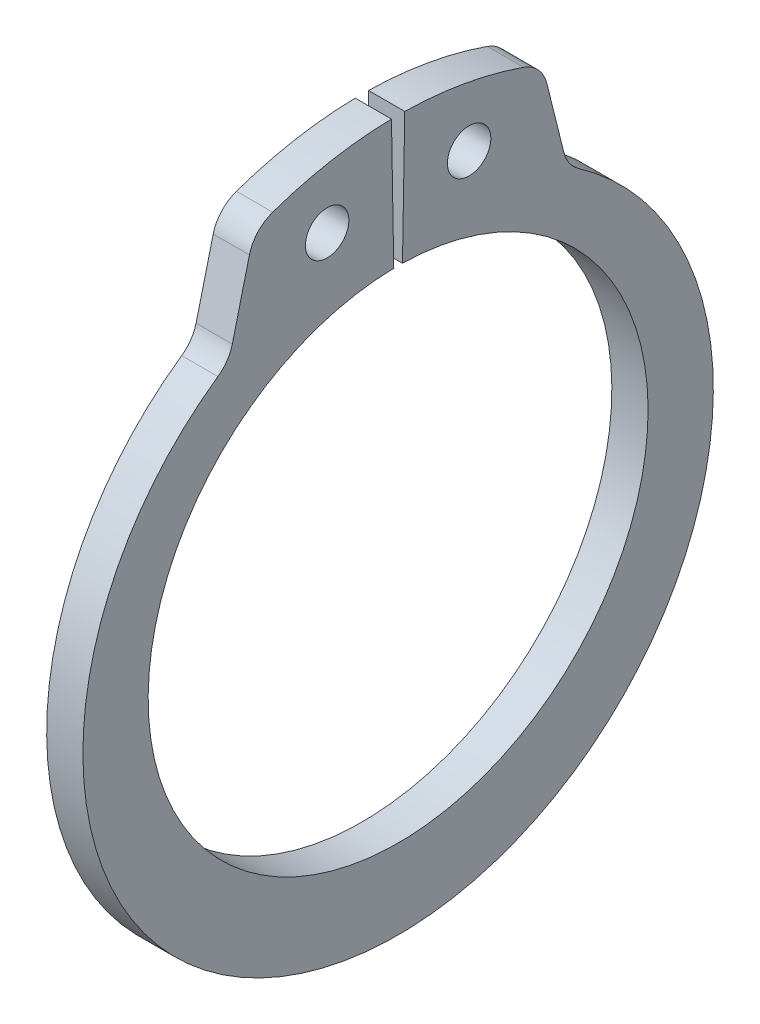
ISO-10303-21;
HEADER;
FILE_DESCRIPTION(('STEP AP214'),'2;1');
FILE_NAME('part.step','',(''),(''),'','','');
FILE_SCHEMA(('AUTOMOTIVE_DESIGN { 1 0 10303 214 1 1 1 1 }'));
ENDSEC;
DATA;
#1=APPLICATION_CONTEXT('core data for automotive mechanical design processes');
#2=APPLICATION_PROTOCOL_DEFINITION('international standard','automotive_design',2000,#1);
#3=PRODUCT_CONTEXT('',#1,'mechanical');
#4=PRODUCT('Part','Part','',(#3));
#5=PRODUCT_RELATED_PRODUCT_CATEGORY('part','',(#4));
#6=PRODUCT_DEFINITION_FORMATION('','',#4);
#7=PRODUCT_DEFINITION_CONTEXT('part definition',#1,'design');
#8=PRODUCT_DEFINITION('design','',#6,#7);
#9=PRODUCT_DEFINITION_SHAPE('','',#8);
#10=(LENGTH_UNIT() NAMED_UNIT(*) SI_UNIT(.MILLI.,.METRE.));
#11=(NAMED_UNIT(*) PLANE_ANGLE_UNIT() SI_UNIT($,.RADIAN.));
#12=(NAMED_UNIT(*) SI_UNIT($,.STERADIAN.) SOLID_ANGLE_UNIT());
#13=UNCERTAINTY_MEASURE_WITH_UNIT(LENGTH_MEASURE(1.E-05),#10,'distance_accuracy_value','');
#14=(GEOMETRIC_REPRESENTATION_CONTEXT(3) GLOBAL_UNCERTAINTY_ASSIGNED_CONTEXT((#13)) GLOBAL_UNIT_ASSIGNED_CONTEXT((#10,
#11,#12)) REPRESENTATION_CONTEXT('',''));
#15=CARTESIAN_POINT('',(0.,0.,0.));
#16=DIRECTION('',(0.,0.,1.));
#17=DIRECTION('',(1.,0.,0.));
#18=AXIS2_PLACEMENT_3D('',#15,#16,#17);
#19=CARTESIAN_POINT('',(-0.5,0.,0.));
#20=DIRECTION('',(1.,0.,0.));
#21=DIRECTION('',(0.,0.,-1.));
#22=AXIS2_PLACEMENT_3D('',#19,#20,#21);
#23=PLANE('',#22);
#24=CARTESIAN_POINT('',(-0.5,8.66711980549,-1.95962883162));
#25=DIRECTION('',(-1.,0.,0.));
#26=DIRECTION('',(0.,0.,1.));
#27=AXIS2_PLACEMENT_3D('',#24,#25,#26);
#28=CIRCLE('',#27,0.6);
#29=CARTESIAN_POINT('',(-0.5,8.66711980549,-1.35962883162));
#30=VERTEX_POINT('',#29);
#31=EDGE_CURVE('E127',#30,#30,#28,.F.);
#32=ORIENTED_EDGE('',*,*,#31,.T.);
#33=EDGE_LOOP('',(#32));
#34=FACE_BOUND('',#33,.T.);
#35=CARTESIAN_POINT('',(-0.5,8.66711980549,1.95962883162));
#36=DIRECTION('',(-1.,0.,0.));
#37=DIRECTION('',(0.,0.,1.));
#38=AXIS2_PLACEMENT_3D('',#35,#36,#37);
#39=CIRCLE('',#38,0.6);
#40=CARTESIAN_POINT('',(-0.5,8.66711980549,2.55962883162));
#41=VERTEX_POINT('',#40);
#42=EDGE_CURVE('E124',#41,#41,#39,.F.);
#43=ORIENTED_EDGE('',*,*,#42,.T.);
#44=EDGE_LOOP('',(#43));
#45=FACE_BOUND('',#44,.T.);
#46=CARTESIAN_POINT('',(-0.5,8.96816184313,3.134018691));
#47=DIRECTION('',(-1.,0.,0.));
#48=DIRECTION('',(0.,0.,1.));
#49=AXIS2_PLACEMENT_3D('',#46,#47,#48);
#50=CIRCLE('',#49,1.);
#51=CARTESIAN_POINT('',(-0.5,9.91217887937307,3.46391539494993));
#52=VERTEX_POINT('',#51);
#53=CARTESIAN_POINT('',(-0.5,9.2100837387247,4.1043144172718));
#54=VERTEX_POINT('',#53);
#55=EDGE_CURVE('E110',#52,#54,#50,.F.);
#56=ORIENTED_EDGE('',*,*,#55,.F.);
#57=CARTESIAN_POINT('',(-0.5,0.,0.));
#58=DIRECTION('',(-1.,0.,0.));
#59=DIRECTION('',(0.,0.,1.));
#60=AXIS2_PLACEMENT_3D('',#57,#58,#59);
#61=CIRCLE('',#60,10.5);
#62=CARTESIAN_POINT('',(-0.5,10.4984007995163,0.18325026759782));
#63=VERTEX_POINT('',#62);
#64=EDGE_CURVE('E20',#63,#52,#61,.F.);
#65=ORIENTED_EDGE('',*,*,#64,.F.);
#66=DIRECTION('',(0.,-0.999847695156391,-0.0174524064373068));
#67=VECTOR('',#66,1.);
#68=CARTESIAN_POINT('',(-0.5,6.89894909658,0.120421604417));
#69=LINE('',#68,#67);
#70=CARTESIAN_POINT('',(-0.5,6.89894909657955,0.120421604416992));
#71=VERTEX_POINT('',#70);
#72=EDGE_CURVE('E107',#63,#71,#69,.T.);
#73=ORIENTED_EDGE('',*,*,#72,.T.);
#74=CARTESIAN_POINT('',(-0.5,0.,0.));
#75=DIRECTION('',(-1.,0.,0.));
#76=DIRECTION('',(0.,0.,1.));
#77=AXIS2_PLACEMENT_3D('',#74,#75,#76);
#78=CIRCLE('',#77,6.9);
#79=CARTESIAN_POINT('',(-0.5,6.89894909657231,-0.120421604806325));
#80=VERTEX_POINT('',#79);
#81=EDGE_CURVE('E173',#71,#80,#78,.F.);
#82=ORIENTED_EDGE('',*,*,#81,.T.);
#83=DIRECTION('',(0.,0.999847695156391,-0.0174524064373068));
#84=VECTOR('',#83,1.);
#85=CARTESIAN_POINT('',(-0.5,10.4984007991,-0.183250267591));
#86=LINE('',#85,#84);
#87=CARTESIAN_POINT('',(-0.5,10.4984007995163,-0.183250267598266));
#88=VERTEX_POINT('',#87);
#89=EDGE_CURVE('E132',#80,#88,#86,.T.);
#90=ORIENTED_EDGE('',*,*,#89,.T.);
#91=CARTESIAN_POINT('',(-0.5,0.,0.));
#92=DIRECTION('',(-1.,0.,0.));
#93=DIRECTION('',(0.,0.,1.));
#94=AXIS2_PLACEMENT_3D('',#91,#92,#93);
#95=CIRCLE('',#94,10.5);
#96=CARTESIAN_POINT('',(-0.5,9.91217887937308,-3.46391539494993));
#97=VERTEX_POINT('',#96);
#98=EDGE_CURVE('E175',#97,#88,#95,.F.);
#99=ORIENTED_EDGE('',*,*,#98,.F.);
#100=CARTESIAN_POINT('',(-0.5,8.96816184313,-3.134018691));
#101=DIRECTION('',(-1.,0.,0.));
#102=DIRECTION('',(0.,0.,1.));
#103=AXIS2_PLACEMENT_3D('',#100,#101,#102);
#104=CIRCLE('',#103,1.);
#105=CARTESIAN_POINT('',(-0.5,9.21008373844506,-4.10431441734424));
#106=VERTEX_POINT('',#105);
#107=EDGE_CURVE('E178',#106,#97,#104,.F.);
#108=ORIENTED_EDGE('',*,*,#107,.F.);
#109=DIRECTION('',(0.,-0.970295726275919,-0.24192189559998));
#110=VECTOR('',#109,1.);
#111=CARTESIAN_POINT('',(-0.5,9.71734472746,-3.97784004803));
#112=LINE('',#111,#110);
#113=CARTESIAN_POINT('',(-0.5,7.31761530938444,-4.57615979120363));
#114=VERTEX_POINT('',#113);
#115=EDGE_CURVE('E137',#106,#114,#112,.T.);
#116=ORIENTED_EDGE('',*,*,#115,.T.);
#117=CARTESIAN_POINT('',(-0.5,7.55953720485,-5.54645551751));
#118=DIRECTION('',(-1.,0.,0.));
#119=DIRECTION('',(0.,0.,1.));
#120=AXIS2_PLACEMENT_3D('',#117,#118,#119);
#121=CIRCLE('',#120,1.);
#122=CARTESIAN_POINT('',(-0.5,6.73911195964504,-4.97470170945064));
#123=VERTEX_POINT('',#122);
#124=EDGE_CURVE('E180',#114,#123,#121,.F.);
#125=ORIENTED_EDGE('',*,*,#124,.T.);
#126=CARTESIAN_POINT('',(-0.5,-0.39922417777,0.));
#127=DIRECTION('',(-1.,0.,0.));
#128=DIRECTION('',(0.,0.,1.));
#129=AXIS2_PLACEMENT_3D('',#126,#127,#128);
#130=CIRCLE('',#129,8.70077582223);
#131=CARTESIAN_POINT('',(-0.5,6.73911195964422,4.97470170945008));
#132=VERTEX_POINT('',#131);
#133=EDGE_CURVE('E183',#132,#123,#130,.F.);
#134=ORIENTED_EDGE('',*,*,#133,.F.);
#135=CARTESIAN_POINT('',(-0.5,7.55953720485,5.54645551751));
#136=DIRECTION('',(-1.,0.,0.));
#137=DIRECTION('',(0.,0.,1.));
#138=AXIS2_PLACEMENT_3D('',#135,#136,#137);
#139=CIRCLE('',#138,1.);
#140=CARTESIAN_POINT('',(-0.5,7.31761530938408,4.57615979120219));
#141=VERTEX_POINT('',#140);
#142=EDGE_CURVE('E143',#132,#141,#139,.F.);
#143=ORIENTED_EDGE('',*,*,#142,.T.);
#144=DIRECTION('',(0.,0.970295726275919,-0.24192189559998));
#145=VECTOR('',#144,1.);
#146=CARTESIAN_POINT('',(-0.5,9.71734472746,3.97784004803));
#147=LINE('',#146,#145);
#148=EDGE_CURVE('E142',#141,#54,#147,.T.);
#149=ORIENTED_EDGE('',*,*,#148,.T.);
#150=EDGE_LOOP('',(#56,#65,#73,#82,#90,#99,#108,#116,#125,#134,#143,#149));
#151=FACE_BOUND('',#150,.T.);
#152=ADVANCED_FACE('F17',(#34,#45,#151),#23,.F.);
#153=CARTESIAN_POINT('',(0.5,0.,0.));
#154=DIRECTION('',(-1.,0.,0.));
#155=DIRECTION('',(0.,0.,1.));
#156=AXIS2_PLACEMENT_3D('',#153,#154,#155);
#157=CYLINDRICAL_SURFACE('',#156,10.5);
#158=CARTESIAN_POINT('',(0.5,0.,0.));
#159=DIRECTION('',(-1.,0.,0.));
#160=DIRECTION('',(0.,0.,1.));
#161=AXIS2_PLACEMENT_3D('',#158,#159,#160);
#162=CIRCLE('',#161,10.5);
#163=CARTESIAN_POINT('',(0.5,10.498400799521,0.183250267325144));
#164=VERTEX_POINT('',#163);
#165=CARTESIAN_POINT('',(0.5,9.91217887937582,3.46391539495089));
#166=VERTEX_POINT('',#165);
#167=EDGE_CURVE('E118',#164,#166,#162,.F.);
#168=ORIENTED_EDGE('',*,*,#167,.F.);
#169=DIRECTION('',(1.,0.,0.));
#170=VECTOR('',#169,1.);
#171=CARTESIAN_POINT('',(0.5,10.4984007998905,0.183250267604352));
#172=LINE('',#171,#170);
#173=EDGE_CURVE('E115',#164,#63,#172,.F.);
#174=ORIENTED_EDGE('',*,*,#173,.T.);
#175=ORIENTED_EDGE('',*,*,#64,.T.);
#176=DIRECTION('',(-1.,0.,0.));
#177=VECTOR('',#176,1.);
#178=CARTESIAN_POINT('',(0.5,9.91217887950327,3.46391539458619));
#179=LINE('',#178,#177);
#180=EDGE_CURVE('E113',#166,#52,#179,.T.);
#181=ORIENTED_EDGE('',*,*,#180,.F.);
#182=EDGE_LOOP('',(#168,#174,#175,#181));
#183=FACE_BOUND('',#182,.T.);
#184=ADVANCED_FACE('F116',(#183),#157,.T.);
#185=CARTESIAN_POINT('',(0.5,8.96816184313,3.134018691));
#186=DIRECTION('',(-1.,0.,0.));
#187=DIRECTION('',(0.,0.,1.));
#188=AXIS2_PLACEMENT_3D('',#185,#186,#187);
#189=CYLINDRICAL_SURFACE('',#188,1.);
#190=ORIENTED_EDGE('',*,*,#55,.T.);
#191=DIRECTION('',(1.,0.,0.));
#192=VECTOR('',#191,1.);
#193=CARTESIAN_POINT('',(0.5,9.2100837387207,4.1043144172728));
#194=LINE('',#193,#192);
#195=CARTESIAN_POINT('',(0.5,9.21008373904296,4.10431441678747));
#196=VERTEX_POINT('',#195);
#197=EDGE_CURVE('E144',#54,#196,#194,.T.);
#198=ORIENTED_EDGE('',*,*,#197,.T.);
#199=CARTESIAN_POINT('',(0.5,8.96816184313,3.134018691));
#200=DIRECTION('',(-1.,0.,0.));
#201=DIRECTION('',(0.,0.,1.));
#202=AXIS2_PLACEMENT_3D('',#199,#200,#201);
#203=CIRCLE('',#202,1.);
#204=EDGE_CURVE('E167',#166,#196,#203,.F.);
#205=ORIENTED_EDGE('',*,*,#204,.F.);
#206=ORIENTED_EDGE('',*,*,#180,.T.);
#207=EDGE_LOOP('',(#190,#198,#205,#206));
#208=FACE_BOUND('',#207,.T.);
#209=ADVANCED_FACE('F190',(#208),#189,.T.);
#210=CARTESIAN_POINT('',(0.5,9.71734472746,3.97784004803));
#211=DIRECTION('',(0.,-0.24192189559998,-0.970295726275919));
#212=DIRECTION('',(0.,0.970295726275919,-0.24192189559998));
#213=AXIS2_PLACEMENT_3D('',#210,#211,#212);
#214=PLANE('',#213);
#215=DIRECTION('',(-1.,0.,0.));
#216=VECTOR('',#215,1.);
#217=CARTESIAN_POINT('',(0.5,7.31761530951743,4.57615979116741));
#218=LINE('',#217,#216);
#219=CARTESIAN_POINT('',(0.5,7.31761530907669,4.57615979173009));
#220=VERTEX_POINT('',#219);
#221=EDGE_CURVE('E187',#141,#220,#218,.F.);
#222=ORIENTED_EDGE('',*,*,#221,.T.);
#223=DIRECTION('',(0.,-0.970295726069815,0.241921896426616));
#224=VECTOR('',#223,1.);
#225=CARTESIAN_POINT('',(0.5,9.21008373797,4.10431441665));
#226=LINE('',#225,#224);
#227=EDGE_CURVE('E166',#196,#220,#226,.T.);
#228=ORIENTED_EDGE('',*,*,#227,.F.);
#229=ORIENTED_EDGE('',*,*,#197,.F.);
#230=ORIENTED_EDGE('',*,*,#148,.F.);
#231=EDGE_LOOP('',(#222,#228,#229,#230));
#232=FACE_BOUND('',#231,.T.);
#233=ADVANCED_FACE('F217',(#232),#214,.F.);
#234=CARTESIAN_POINT('',(0.5,7.55953720485,5.54645551751));
#235=DIRECTION('',(-1.,0.,0.));
#236=DIRECTION('',(0.,0.,1.));
#237=AXIS2_PLACEMENT_3D('',#234,#235,#236);
#238=CYLINDRICAL_SURFACE('',#237,1.);
#239=ORIENTED_EDGE('',*,*,#221,.F.);
#240=ORIENTED_EDGE('',*,*,#142,.F.);
#241=DIRECTION('',(-1.,0.,0.));
#242=VECTOR('',#241,1.);
#243=CARTESIAN_POINT('',(0.5,6.73911195964207,4.97470170945144));
#244=LINE('',#243,#242);
#245=CARTESIAN_POINT('',(0.5,6.73911195964341,4.97470170944951));
#246=VERTEX_POINT('',#245);
#247=EDGE_CURVE('E186',#246,#132,#244,.T.);
#248=ORIENTED_EDGE('',*,*,#247,.F.);
#249=CARTESIAN_POINT('',(0.5,7.55953720485,5.54645551751));
#250=DIRECTION('',(-1.,0.,0.));
#251=DIRECTION('',(0.,0.,1.));
#252=AXIS2_PLACEMENT_3D('',#249,#250,#251);
#253=CIRCLE('',#252,1.);
#254=EDGE_CURVE('E163',#220,#246,#253,.T.);
#255=ORIENTED_EDGE('',*,*,#254,.F.);
#256=EDGE_LOOP('',(#239,#240,#248,#255));
#257=FACE_BOUND('',#256,.T.);
#258=ADVANCED_FACE('F220',(#257),#238,.F.);
#259=CARTESIAN_POINT('',(0.5,-0.39922417777,0.));
#260=DIRECTION('',(-1.,0.,0.));
#261=DIRECTION('',(0.,0.,1.));
#262=AXIS2_PLACEMENT_3D('',#259,#260,#261);
#263=CYLINDRICAL_SURFACE('',#262,8.70077582223);
#264=ORIENTED_EDGE('',*,*,#133,.T.);
#265=DIRECTION('',(-1.,0.,0.));
#266=VECTOR('',#265,1.);
#267=CARTESIAN_POINT('',(0.5,6.73911195964369,-4.97470170945257));
#268=LINE('',#267,#266);
#269=CARTESIAN_POINT('',(0.5,6.73911195964504,-4.97470170945064));
#270=VERTEX_POINT('',#269);
#271=EDGE_CURVE('E182',#123,#270,#268,.F.);
#272=ORIENTED_EDGE('',*,*,#271,.T.);
#273=CARTESIAN_POINT('',(0.5,-0.39922417777,0.));
#274=DIRECTION('',(-1.,0.,0.));
#275=DIRECTION('',(0.,0.,1.));
#276=AXIS2_PLACEMENT_3D('',#273,#274,#275);
#277=CIRCLE('',#276,8.70077582223);
#278=EDGE_CURVE('E161',#246,#270,#277,.F.);
#279=ORIENTED_EDGE('',*,*,#278,.F.);
#280=ORIENTED_EDGE('',*,*,#247,.T.);
#281=EDGE_LOOP('',(#264,#272,#279,#280));
#282=FACE_BOUND('',#281,.T.);
#283=ADVANCED_FACE('F225',(#282),#263,.T.);
#284=CARTESIAN_POINT('',(0.5,7.55953720485,-5.54645551751));
#285=DIRECTION('',(-1.,0.,0.));
#286=DIRECTION('',(0.,0.,1.));
#287=AXIS2_PLACEMENT_3D('',#284,#285,#286);
#288=CYLINDRICAL_SURFACE('',#287,1.);
#289=ORIENTED_EDGE('',*,*,#271,.F.);
#290=ORIENTED_EDGE('',*,*,#124,.F.);
#291=DIRECTION('',(1.,0.,0.));
#292=VECTOR('',#291,1.);
#293=CARTESIAN_POINT('',(0.5,7.31761530951814,-4.57615979117029));
#294=LINE('',#293,#292);
#295=CARTESIAN_POINT('',(0.5,7.3176153091886,-4.57615979125388));
#296=VERTEX_POINT('',#295);
#297=EDGE_CURVE('E141',#114,#296,#294,.T.);
#298=ORIENTED_EDGE('',*,*,#297,.T.);
#299=CARTESIAN_POINT('',(0.5,7.55953720485,-5.54645551751));
#300=DIRECTION('',(-1.,0.,0.));
#301=DIRECTION('',(0.,0.,1.));
#302=AXIS2_PLACEMENT_3D('',#299,#300,#301);
#303=CIRCLE('',#302,1.);
#304=EDGE_CURVE('E158',#270,#296,#303,.T.);
#305=ORIENTED_EDGE('',*,*,#304,.F.);
#306=EDGE_LOOP('',(#289,#290,#298,#305));
#307=FACE_BOUND('',#306,.T.);
#308=ADVANCED_FACE('F227',(#307),#288,.F.);
#309=CARTESIAN_POINT('',(0.5,9.71734472746,-3.97784004803));
#310=DIRECTION('',(0.,-0.24192189559998,0.970295726275919));
#311=DIRECTION('',(0.,-0.970295726275919,-0.24192189559998));
#312=AXIS2_PLACEMENT_3D('',#309,#310,#311);
#313=PLANE('',#312);
#314=DIRECTION('',(-1.,0.,0.));
#315=VECTOR('',#314,1.);
#316=CARTESIAN_POINT('',(0.5,9.2100837381614,-4.10431441741768));
#317=LINE('',#316,#315);
#318=CARTESIAN_POINT('',(0.5,9.21008373854617,-4.10431441691405));
#319=VERTEX_POINT('',#318);
#320=EDGE_CURVE('E140',#319,#106,#317,.T.);
#321=ORIENTED_EDGE('',*,*,#320,.F.);
#322=DIRECTION('',(0.,0.970295726178093,0.241921895992336));
#323=VECTOR('',#322,1.);
#324=CARTESIAN_POINT('',(0.5,7.31761530925,-4.57615979124));
#325=LINE('',#324,#323);
#326=EDGE_CURVE('E157',#296,#319,#325,.T.);
#327=ORIENTED_EDGE('',*,*,#326,.F.);
#328=ORIENTED_EDGE('',*,*,#297,.F.);
#329=ORIENTED_EDGE('',*,*,#115,.F.);
#330=EDGE_LOOP('',(#321,#327,#328,#329));
#331=FACE_BOUND('',#330,.T.);
#332=ADVANCED_FACE('F231',(#331),#313,.F.);
#333=CARTESIAN_POINT('',(0.5,8.96816184313,-3.134018691));
#334=DIRECTION('',(-1.,0.,0.));
#335=DIRECTION('',(0.,0.,1.));
#336=AXIS2_PLACEMENT_3D('',#333,#334,#335);
#337=CYLINDRICAL_SURFACE('',#336,1.);
#338=ORIENTED_EDGE('',*,*,#107,.T.);
#339=DIRECTION('',(-1.,0.,0.));
#340=VECTOR('',#339,1.);
#341=CARTESIAN_POINT('',(0.5,9.91217887949779,-3.46391539458428));
#342=LINE('',#341,#340);
#343=CARTESIAN_POINT('',(0.5,9.91217887937034,-3.46391539494898));
#344=VERTEX_POINT('',#343);
#345=EDGE_CURVE('E177',#344,#97,#342,.T.);
#346=ORIENTED_EDGE('',*,*,#345,.F.);
#347=CARTESIAN_POINT('',(0.5,8.96816184313,-3.134018691));
#348=DIRECTION('',(-1.,0.,0.));
#349=DIRECTION('',(0.,0.,1.));
#350=AXIS2_PLACEMENT_3D('',#347,#348,#349);
#351=CIRCLE('',#350,1.);
#352=EDGE_CURVE('E154',#319,#344,#351,.F.);
#353=ORIENTED_EDGE('',*,*,#352,.F.);
#354=ORIENTED_EDGE('',*,*,#320,.T.);
#355=EDGE_LOOP('',(#338,#346,#353,#354));
#356=FACE_BOUND('',#355,.T.);
#357=ADVANCED_FACE('F235',(#356),#337,.T.);
#358=CARTESIAN_POINT('',(0.5,0.,0.));
#359=DIRECTION('',(-1.,0.,0.));
#360=DIRECTION('',(0.,0.,1.));
#361=AXIS2_PLACEMENT_3D('',#358,#359,#360);
#362=CYLINDRICAL_SURFACE('',#361,10.5);
#363=ORIENTED_EDGE('',*,*,#98,.T.);
#364=DIRECTION('',(1.,0.,0.));
#365=VECTOR('',#364,1.);
#366=CARTESIAN_POINT('',(0.5,10.4984007998905,-0.183250267604798));
#367=LINE('',#366,#365);
#368=CARTESIAN_POINT('',(0.5,10.4984007995211,-0.183250267325367));
#369=VERTEX_POINT('',#368);
#370=EDGE_CURVE('E136',#88,#369,#367,.T.);
#371=ORIENTED_EDGE('',*,*,#370,.T.);
#372=CARTESIAN_POINT('',(0.5,0.,0.));
#373=DIRECTION('',(-1.,0.,0.));
#374=DIRECTION('',(0.,0.,1.));
#375=AXIS2_PLACEMENT_3D('',#372,#373,#374);
#376=CIRCLE('',#375,10.5);
#377=EDGE_CURVE('E151',#344,#369,#376,.F.);
#378=ORIENTED_EDGE('',*,*,#377,.F.);
#379=ORIENTED_EDGE('',*,*,#345,.T.);
#380=EDGE_LOOP('',(#363,#371,#378,#379));
#381=FACE_BOUND('',#380,.T.);
#382=ADVANCED_FACE('F239',(#381),#362,.T.);
#383=CARTESIAN_POINT('',(0.5,10.4984007991,-0.183250267591));
#384=DIRECTION('',(0.,-0.0174524064373068,-0.999847695156391));
#385=DIRECTION('',(0.,0.999847695156391,-0.0174524064373068));
#386=AXIS2_PLACEMENT_3D('',#383,#384,#385);
#387=PLANE('',#386);
#388=DIRECTION('',(-1.,0.,0.));
#389=VECTOR('',#388,1.);
#390=CARTESIAN_POINT('',(0.5,6.89894909656552,-0.12042160519522));
#391=LINE('',#390,#389);
#392=CARTESIAN_POINT('',(0.5,6.89894909656552,-0.12042160519522));
#393=VERTEX_POINT('',#392);
#394=EDGE_CURVE('E135',#80,#393,#391,.F.);
#395=ORIENTED_EDGE('',*,*,#394,.T.);
#396=DIRECTION('',(0.,-0.999847695162808,0.0174524060696436));
#397=VECTOR('',#396,1.);
#398=CARTESIAN_POINT('',(0.5,10.4984007999,-0.183250267059));
#399=LINE('',#398,#397);
#400=EDGE_CURVE('E150',#369,#393,#399,.T.);
#401=ORIENTED_EDGE('',*,*,#400,.F.);
#402=ORIENTED_EDGE('',*,*,#370,.F.);
#403=ORIENTED_EDGE('',*,*,#89,.F.);
#404=EDGE_LOOP('',(#395,#401,#402,#403));
#405=FACE_BOUND('',#404,.T.);
#406=ADVANCED_FACE('F244',(#405),#387,.F.);
#407=CARTESIAN_POINT('',(0.5,0.,0.));
#408=DIRECTION('',(-1.,0.,0.));
#409=DIRECTION('',(0.,0.,1.));
#410=AXIS2_PLACEMENT_3D('',#407,#408,#409);
#411=CYLINDRICAL_SURFACE('',#410,6.9);
#412=DIRECTION('',(1.,0.,0.));
#413=VECTOR('',#412,1.);
#414=CARTESIAN_POINT('',(0.5,6.89894909658,0.120421604417));
#415=LINE('',#414,#413);
#416=CARTESIAN_POINT('',(0.5,6.89894909657955,0.120421604416992));
#417=VERTEX_POINT('',#416);
#418=EDGE_CURVE('E121',#71,#417,#415,.T.);
#419=ORIENTED_EDGE('',*,*,#418,.T.);
#420=CARTESIAN_POINT('',(0.5,0.,0.));
#421=DIRECTION('',(-1.,0.,0.));
#422=DIRECTION('',(0.,0.,1.));
#423=AXIS2_PLACEMENT_3D('',#420,#421,#422);
#424=CIRCLE('',#423,6.9);
#425=EDGE_CURVE('E35',#393,#417,#424,.T.);
#426=ORIENTED_EDGE('',*,*,#425,.F.);
#427=ORIENTED_EDGE('',*,*,#394,.F.);
#428=ORIENTED_EDGE('',*,*,#81,.F.);
#429=EDGE_LOOP('',(#419,#426,#427,#428));
#430=FACE_BOUND('',#429,.T.);
#431=ADVANCED_FACE('F247',(#430),#411,.F.);
#432=CARTESIAN_POINT('',(0.5,6.89894909658,0.120421604417));
#433=DIRECTION('',(0.,-0.0174524064373068,0.999847695156391));
#434=DIRECTION('',(0.,-0.999847695156391,-0.0174524064373068));
#435=AXIS2_PLACEMENT_3D('',#432,#433,#434);
#436=PLANE('',#435);
#437=ORIENTED_EDGE('',*,*,#173,.F.);
#438=DIRECTION('',(0.,0.999847695159035,0.0174524062858202));
#439=VECTOR('',#438,1.);
#440=CARTESIAN_POINT('',(0.5,6.89894909658,0.120421604417));
#441=LINE('',#440,#439);
#442=EDGE_CURVE('E148',#417,#164,#441,.T.);
#443=ORIENTED_EDGE('',*,*,#442,.F.);
#444=ORIENTED_EDGE('',*,*,#418,.F.);
#445=ORIENTED_EDGE('',*,*,#72,.F.);
#446=EDGE_LOOP('',(#437,#443,#444,#445));
#447=FACE_BOUND('',#446,.T.);
#448=ADVANCED_FACE('F123',(#447),#436,.F.);
#449=CARTESIAN_POINT('',(0.5,8.66711980549,1.95962883162));
#450=DIRECTION('',(-1.,0.,0.));
#451=DIRECTION('',(0.,0.,1.));
#452=AXIS2_PLACEMENT_3D('',#449,#450,#451);
#453=CYLINDRICAL_SURFACE('',#452,0.6);
#454=CARTESIAN_POINT('',(0.5,8.66711980549,1.95962883162));
#455=DIRECTION('',(-1.,0.,0.));
#456=DIRECTION('',(0.,0.,1.));
#457=AXIS2_PLACEMENT_3D('',#454,#455,#456);
#458=CIRCLE('',#457,0.6);
#459=CARTESIAN_POINT('',(0.5,8.66711980549,2.55962883162));
#460=VERTEX_POINT('',#459);
#461=EDGE_CURVE('E26',#460,#460,#458,.T.);
#462=ORIENTED_EDGE('',*,*,#461,.F.);
#463=EDGE_LOOP('',(#462));
#464=FACE_BOUND('',#463,.T.);
#465=ORIENTED_EDGE('',*,*,#42,.F.);
#466=EDGE_LOOP('',(#465));
#467=FACE_BOUND('',#466,.T.);
#468=ADVANCED_FACE('F255',(#464,#467),#453,.F.);
#469=CARTESIAN_POINT('',(0.5,8.66711980549,-1.95962883162));
#470=DIRECTION('',(-1.,0.,0.));
#471=DIRECTION('',(0.,0.,1.));
#472=AXIS2_PLACEMENT_3D('',#469,#470,#471);
#473=CYLINDRICAL_SURFACE('',#472,0.6);
#474=CARTESIAN_POINT('',(0.5,8.66711980549,-1.95962883162));
#475=DIRECTION('',(-1.,0.,0.));
#476=DIRECTION('',(0.,0.,1.));
#477=AXIS2_PLACEMENT_3D('',#474,#475,#476);
#478=CIRCLE('',#477,0.6);
#479=CARTESIAN_POINT('',(0.5,8.66711980549,-1.35962883162));
#480=VERTEX_POINT('',#479);
#481=EDGE_CURVE('E11',#480,#480,#478,.T.);
#482=ORIENTED_EDGE('',*,*,#481,.F.);
#483=EDGE_LOOP('',(#482));
#484=FACE_BOUND('',#483,.T.);
#485=ORIENTED_EDGE('',*,*,#31,.F.);
#486=EDGE_LOOP('',(#485));
#487=FACE_BOUND('',#486,.T.);
#488=ADVANCED_FACE('F259',(#484,#487),#473,.F.);
#489=CARTESIAN_POINT('',(0.5,0.,0.));
#490=DIRECTION('',(1.,0.,0.));
#491=DIRECTION('',(0.,0.,-1.));
#492=AXIS2_PLACEMENT_3D('',#489,#490,#491);
#493=PLANE('',#492);
#494=ORIENTED_EDGE('',*,*,#481,.T.);
#495=EDGE_LOOP('',(#494));
#496=FACE_BOUND('',#495,.T.);
#497=ORIENTED_EDGE('',*,*,#461,.T.);
#498=EDGE_LOOP('',(#497));
#499=FACE_BOUND('',#498,.T.);
#500=ORIENTED_EDGE('',*,*,#425,.T.);
#501=ORIENTED_EDGE('',*,*,#442,.T.);
#502=ORIENTED_EDGE('',*,*,#167,.T.);
#503=ORIENTED_EDGE('',*,*,#204,.T.);
#504=ORIENTED_EDGE('',*,*,#227,.T.);
#505=ORIENTED_EDGE('',*,*,#254,.T.);
#506=ORIENTED_EDGE('',*,*,#278,.T.);
#507=ORIENTED_EDGE('',*,*,#304,.T.);
#508=ORIENTED_EDGE('',*,*,#326,.T.);
#509=ORIENTED_EDGE('',*,*,#352,.T.);
#510=ORIENTED_EDGE('',*,*,#377,.T.);
#511=ORIENTED_EDGE('',*,*,#400,.T.);
#512=EDGE_LOOP('',(#500,#501,#502,#503,#504,#505,#506,#507,#508,#509,#510,#511));
#513=FACE_BOUND('',#512,.T.);
#514=ADVANCED_FACE('F194',(#496,#499,#513),#493,.T.);
#515=CLOSED_SHELL('',(#152,#184,#209,#233,#258,#283,#308,#332,#357,#382,#406,#431,#448,#468,
#488,#514));
#516=MANIFOLD_SOLID_BREP('B1',#515);
#517=ADVANCED_BREP_SHAPE_REPRESENTATION('',(#18,#516),#14);
#518=SHAPE_DEFINITION_REPRESENTATION(#9,#517);
ENDSEC;
END-ISO-10303-21;
